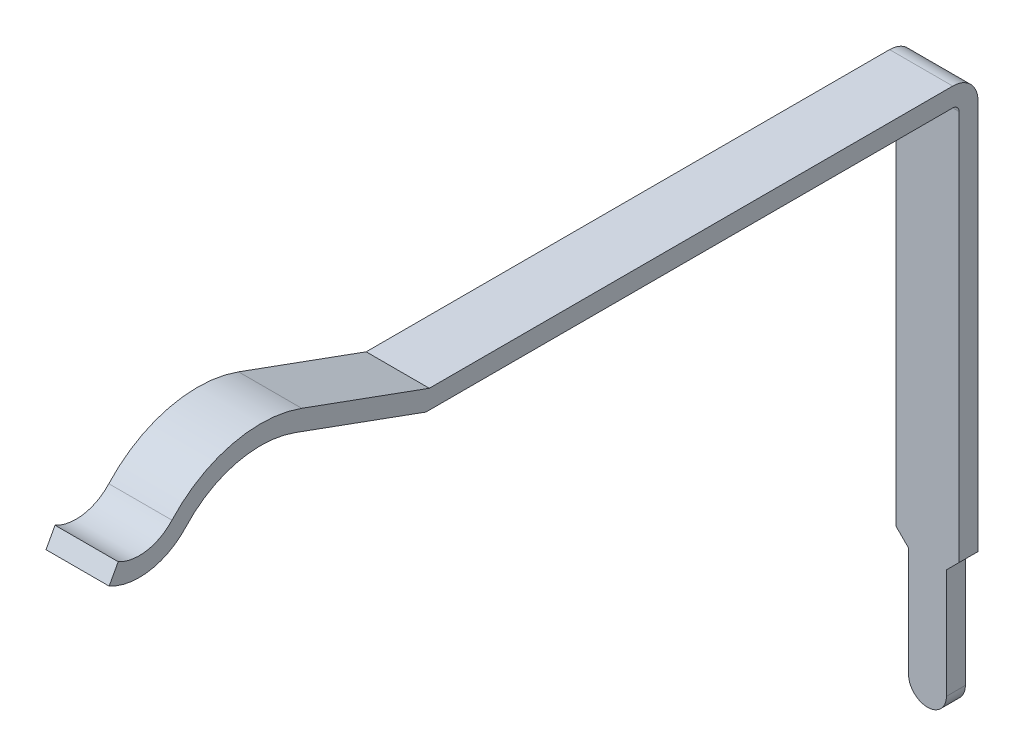
ISO-10303-21;
HEADER;
FILE_DESCRIPTION(('STEP AP214'),'2;1');
FILE_NAME('part.step','',(''),(''),'','','');
FILE_SCHEMA(('AUTOMOTIVE_DESIGN { 1 0 10303 214 1 1 1 1 }'));
ENDSEC;
DATA;
#1=APPLICATION_CONTEXT('core data for automotive mechanical design processes');
#2=APPLICATION_PROTOCOL_DEFINITION('international standard','automotive_design',2000,#1);
#3=PRODUCT_CONTEXT('',#1,'mechanical');
#4=PRODUCT('Part','Part','',(#3));
#5=PRODUCT_RELATED_PRODUCT_CATEGORY('part','',(#4));
#6=PRODUCT_DEFINITION_FORMATION('','',#4);
#7=PRODUCT_DEFINITION_CONTEXT('part definition',#1,'design');
#8=PRODUCT_DEFINITION('design','',#6,#7);
#9=PRODUCT_DEFINITION_SHAPE('','',#8);
#10=(LENGTH_UNIT() NAMED_UNIT(*) SI_UNIT(.MILLI.,.METRE.));
#11=(NAMED_UNIT(*) PLANE_ANGLE_UNIT() SI_UNIT($,.RADIAN.));
#12=(NAMED_UNIT(*) SI_UNIT($,.STERADIAN.) SOLID_ANGLE_UNIT());
#13=UNCERTAINTY_MEASURE_WITH_UNIT(LENGTH_MEASURE(1.E-05),#10,'distance_accuracy_value','');
#14=(GEOMETRIC_REPRESENTATION_CONTEXT(3) GLOBAL_UNCERTAINTY_ASSIGNED_CONTEXT((#13)) GLOBAL_UNIT_ASSIGNED_CONTEXT((#10,
#11,#12)) REPRESENTATION_CONTEXT('',''));
#15=CARTESIAN_POINT('',(0.,0.,0.));
#16=DIRECTION('',(0.,0.,1.));
#17=DIRECTION('',(1.,0.,0.));
#18=AXIS2_PLACEMENT_3D('',#15,#16,#17);
#19=CARTESIAN_POINT('',(0.5,-0.1,-14.36));
#20=DIRECTION('',(-1.,0.,0.));
#21=DIRECTION('',(0.,0.,1.));
#22=AXIS2_PLACEMENT_3D('',#19,#20,#21);
#23=CYLINDRICAL_SURFACE('',#22,0.399999999999999);
#24=DIRECTION('',(-1.,0.,0.));
#25=VECTOR('',#24,1.);
#26=CARTESIAN_POINT('',(0.,0.3,-14.36));
#27=LINE('',#26,#25);
#28=CARTESIAN_POINT('',(0.5,0.300000000311152,-14.36));
#29=VERTEX_POINT('',#28);
#30=CARTESIAN_POINT('',(-0.5,0.300000000311152,-14.36));
#31=VERTEX_POINT('',#30);
#32=EDGE_CURVE('E200',#29,#31,#27,.T.);
#33=ORIENTED_EDGE('',*,*,#32,.F.);
#34=CARTESIAN_POINT('',(0.5,-0.1,-14.36));
#35=DIRECTION('',(-1.,0.,0.));
#36=DIRECTION('',(0.,0.,1.));
#37=AXIS2_PLACEMENT_3D('',#34,#35,#36);
#38=CIRCLE('',#37,0.399999999999999);
#39=CARTESIAN_POINT('',(0.5,-0.1,-14.76));
#40=VERTEX_POINT('',#39);
#41=EDGE_CURVE('E237',#40,#29,#38,.F.);
#42=ORIENTED_EDGE('',*,*,#41,.F.);
#43=DIRECTION('',(1.,0.,0.));
#44=VECTOR('',#43,1.);
#45=CARTESIAN_POINT('',(0.,-0.1,-14.76));
#46=LINE('',#45,#44);
#47=CARTESIAN_POINT('',(-0.5,-0.1,-14.76));
#48=VERTEX_POINT('',#47);
#49=EDGE_CURVE('E151',#48,#40,#46,.T.);
#50=ORIENTED_EDGE('',*,*,#49,.F.);
#51=CARTESIAN_POINT('',(-0.5,-0.1,-14.36));
#52=DIRECTION('',(-1.,0.,0.));
#53=DIRECTION('',(0.,0.,1.));
#54=AXIS2_PLACEMENT_3D('',#51,#52,#53);
#55=CIRCLE('',#54,0.399999999999999);
#56=EDGE_CURVE('E205',#48,#31,#55,.F.);
#57=ORIENTED_EDGE('',*,*,#56,.T.);
#58=EDGE_LOOP('',(#33,#42,#50,#57));
#59=FACE_BOUND('',#58,.T.);
#60=ADVANCED_FACE('F16',(#59),#23,.T.);
#61=CARTESIAN_POINT('',(-0.5,0.3,-14.36));
#62=DIRECTION('',(0.,1.,0.));
#63=DIRECTION('',(0.,0.,1.));
#64=AXIS2_PLACEMENT_3D('',#61,#62,#63);
#65=PLANE('',#64);
#66=DIRECTION('',(0.,0.,1.));
#67=VECTOR('',#66,1.);
#68=CARTESIAN_POINT('',(0.5,0.300000000622303,-7.83872));
#69=LINE('',#68,#67);
#70=CARTESIAN_POINT('',(0.5,0.300000000466727,-6.07037707311936));
#71=VERTEX_POINT('',#70);
#72=EDGE_CURVE('E236',#29,#71,#69,.T.);
#73=ORIENTED_EDGE('',*,*,#72,.F.);
#74=ORIENTED_EDGE('',*,*,#32,.T.);
#75=DIRECTION('',(0.,0.,1.));
#76=VECTOR('',#75,1.);
#77=CARTESIAN_POINT('',(-0.5,0.300000000622303,-7.83872));
#78=LINE('',#77,#76);
#79=CARTESIAN_POINT('',(-0.5,0.300000000311152,-6.07037706914512));
#80=VERTEX_POINT('',#79);
#81=EDGE_CURVE('E262',#31,#80,#78,.T.);
#82=ORIENTED_EDGE('',*,*,#81,.T.);
#83=DIRECTION('',(-1.,0.,0.));
#84=VECTOR('',#83,1.);
#85=CARTESIAN_POINT('',(0.,0.3,-6.07037707));
#86=LINE('',#85,#84);
#87=EDGE_CURVE('E198',#71,#80,#86,.T.);
#88=ORIENTED_EDGE('',*,*,#87,.F.);
#89=EDGE_LOOP('',(#73,#74,#82,#88));
#90=FACE_BOUND('',#89,.T.);
#91=ADVANCED_FACE('F367',(#90),#65,.T.);
#92=CARTESIAN_POINT('',(-0.5,0.3,-6.07037707));
#93=DIRECTION('',(0.,0.939692620883365,-0.342020143057909));
#94=DIRECTION('',(0.,0.342020143057909,0.939692620883365));
#95=AXIS2_PLACEMENT_3D('',#92,#93,#94);
#96=PLANE('',#95);
#97=DIRECTION('',(0.,0.342020140746785,0.939692621724545));
#98=VECTOR('',#97,1.);
#99=CARTESIAN_POINT('',(0.5,0.300000000622303,-6.07037707623872));
#100=LINE('',#99,#98);
#101=CARTESIAN_POINT('',(0.5,1.03541597897149,-4.04983826915849));
#102=VERTEX_POINT('',#101);
#103=EDGE_CURVE('E234',#71,#102,#100,.T.);
#104=ORIENTED_EDGE('',*,*,#103,.F.);
#105=ORIENTED_EDGE('',*,*,#87,.T.);
#106=DIRECTION('',(0.,0.342020143057909,0.939692620883365));
#107=VECTOR('',#106,1.);
#108=CARTESIAN_POINT('',(-0.5,0.3,-6.07037707));
#109=LINE('',#108,#107);
#110=CARTESIAN_POINT('',(-0.5,1.03541597937978,-4.04983827179352));
#111=VERTEX_POINT('',#110);
#112=EDGE_CURVE('E260',#80,#111,#109,.T.);
#113=ORIENTED_EDGE('',*,*,#112,.T.);
#114=DIRECTION('',(-1.,0.,0.));
#115=VECTOR('',#114,1.);
#116=CARTESIAN_POINT('',(0.,1.03541597961914,-4.04983827197282));
#117=LINE('',#116,#115);
#118=EDGE_CURVE('E195',#111,#102,#117,.F.);
#119=ORIENTED_EDGE('',*,*,#118,.T.);
#120=EDGE_LOOP('',(#104,#105,#113,#119));
#121=FACE_BOUND('',#120,.T.);
#122=ADVANCED_FACE('F363',(#121),#96,.T.);
#123=CARTESIAN_POINT('',(0.5,-0.75,-3.4));
#124=DIRECTION('',(-1.,0.,0.));
#125=DIRECTION('',(0.,0.,1.));
#126=AXIS2_PLACEMENT_3D('',#123,#124,#125);
#127=CYLINDRICAL_SURFACE('',#126,1.9);
#128=DIRECTION('',(1.,0.,0.));
#129=VECTOR('',#128,1.);
#130=CARTESIAN_POINT('',(0.,0.52884615384742,-1.99481228515964));
#131=LINE('',#130,#129);
#132=CARTESIAN_POINT('',(0.5,0.528846153901887,-1.99481228505774));
#133=VERTEX_POINT('',#132);
#134=CARTESIAN_POINT('',(-0.5,0.528846153826487,-1.99481228514059));
#135=VERTEX_POINT('',#134);
#136=EDGE_CURVE('E193',#133,#135,#131,.F.);
#137=ORIENTED_EDGE('',*,*,#136,.F.);
#138=CARTESIAN_POINT('',(0.5,-0.75,-3.4));
#139=DIRECTION('',(-1.,0.,0.));
#140=DIRECTION('',(0.,0.,1.));
#141=AXIS2_PLACEMENT_3D('',#138,#139,#140);
#142=CIRCLE('',#141,1.9);
#143=EDGE_CURVE('E232',#102,#133,#142,.F.);
#144=ORIENTED_EDGE('',*,*,#143,.F.);
#145=ORIENTED_EDGE('',*,*,#118,.F.);
#146=CARTESIAN_POINT('',(-0.5,-0.75,-3.4));
#147=DIRECTION('',(-1.,0.,0.));
#148=DIRECTION('',(0.,0.,1.));
#149=AXIS2_PLACEMENT_3D('',#146,#147,#148);
#150=CIRCLE('',#149,1.9);
#151=EDGE_CURVE('E257',#111,#135,#150,.F.);
#152=ORIENTED_EDGE('',*,*,#151,.T.);
#153=EDGE_LOOP('',(#137,#144,#145,#152));
#154=FACE_BOUND('',#153,.T.);
#155=ADVANCED_FACE('F366',(#154),#127,.T.);
#156=CARTESIAN_POINT('',(0.5,1.,-1.477111548));
#157=DIRECTION('',(-1.,0.,0.));
#158=DIRECTION('',(0.,0.,1.));
#159=AXIS2_PLACEMENT_3D('',#156,#157,#158);
#160=CYLINDRICAL_SURFACE('',#159,0.7);
#161=CARTESIAN_POINT('',(0.5,1.,-1.477111548));
#162=DIRECTION('',(-1.,0.,0.));
#163=DIRECTION('',(0.,0.,1.));
#164=AXIS2_PLACEMENT_3D('',#161,#162,#163);
#165=CIRCLE('',#164,0.7);
#166=CARTESIAN_POINT('',(0.5,0.38481007960968,-1.14313346157592));
#167=VERTEX_POINT('',#166);
#168=EDGE_CURVE('E230',#133,#167,#165,.T.);
#169=ORIENTED_EDGE('',*,*,#168,.F.);
#170=ORIENTED_EDGE('',*,*,#136,.T.);
#171=CARTESIAN_POINT('',(-0.5,1.,-1.477111548));
#172=DIRECTION('',(-1.,0.,0.));
#173=DIRECTION('',(0.,0.,1.));
#174=AXIS2_PLACEMENT_3D('',#171,#172,#173);
#175=CIRCLE('',#174,0.7);
#176=CARTESIAN_POINT('',(-0.5,0.384810078226828,-1.14313346412314));
#177=VERTEX_POINT('',#176);
#178=EDGE_CURVE('E254',#135,#177,#175,.T.);
#179=ORIENTED_EDGE('',*,*,#178,.T.);
#180=DIRECTION('',(-1.,0.,0.));
#181=VECTOR('',#180,1.);
#182=CARTESIAN_POINT('',(0.,0.384810078,-1.143133464));
#183=LINE('',#182,#181);
#184=EDGE_CURVE('E191',#167,#177,#183,.T.);
#185=ORIENTED_EDGE('',*,*,#184,.F.);
#186=EDGE_LOOP('',(#169,#170,#179,#185));
#187=FACE_BOUND('',#186,.T.);
#188=ADVANCED_FACE('F361',(#187),#160,.F.);
#189=CARTESIAN_POINT('',(-0.5,0.384810078,-1.143133464));
#190=DIRECTION('',(0.,0.477111547746772,0.878842745322893));
#191=DIRECTION('',(0.,-0.878842745322893,0.477111547746772));
#192=AXIS2_PLACEMENT_3D('',#189,#190,#191);
#193=PLANE('',#192);
#194=DIRECTION('',(0.,-0.878842757719991,0.477111524911232));
#195=VECTOR('',#194,1.);
#196=CARTESIAN_POINT('',(0.5,0.384810080288333,-1.1431334586464));
#197=LINE('',#196,#195);
#198=CARTESIAN_POINT('',(0.5,0.121157254244879,-1.00000000104939));
#199=VERTEX_POINT('',#198);
#200=EDGE_CURVE('E228',#167,#199,#197,.T.);
#201=ORIENTED_EDGE('',*,*,#200,.F.);
#202=ORIENTED_EDGE('',*,*,#184,.T.);
#203=DIRECTION('',(0.,-0.878842745322893,0.477111547746772));
#204=VECTOR('',#203,1.);
#205=CARTESIAN_POINT('',(-0.5,0.384810078,-1.143133464));
#206=LINE('',#205,#204);
#207=CARTESIAN_POINT('',(-0.5,0.121157254721593,-1.00000000017128));
#208=VERTEX_POINT('',#207);
#209=EDGE_CURVE('E251',#177,#208,#206,.T.);
#210=ORIENTED_EDGE('',*,*,#209,.T.);
#211=DIRECTION('',(-1.,0.,0.));
#212=VECTOR('',#211,1.);
#213=CARTESIAN_POINT('',(0.,0.121157254586397,-1.00000000042032));
#214=LINE('',#213,#212);
#215=EDGE_CURVE('E188',#208,#199,#214,.F.);
#216=ORIENTED_EDGE('',*,*,#215,.T.);
#217=EDGE_LOOP('',(#201,#202,#210,#216));
#218=FACE_BOUND('',#217,.T.);
#219=ADVANCED_FACE('F357',(#218),#193,.T.);
#220=CARTESIAN_POINT('',(0.5,1.,-1.477111548));
#221=DIRECTION('',(-1.,0.,0.));
#222=DIRECTION('',(0.,0.,1.));
#223=AXIS2_PLACEMENT_3D('',#220,#221,#222);
#224=CYLINDRICAL_SURFACE('',#223,1.);
#225=DIRECTION('',(1.,0.,0.));
#226=VECTOR('',#225,1.);
#227=CARTESIAN_POINT('',(0.,0.326923076434778,-2.21668402890764));
#228=LINE('',#227,#226);
#229=CARTESIAN_POINT('',(0.5,0.326923076649927,-2.21668402925492));
#230=VERTEX_POINT('',#229);
#231=CARTESIAN_POINT('',(-0.5,0.326923076725328,-2.21668402917207));
#232=VERTEX_POINT('',#231);
#233=EDGE_CURVE('E186',#230,#232,#228,.F.);
#234=ORIENTED_EDGE('',*,*,#233,.F.);
#235=CARTESIAN_POINT('',(0.5,1.,-1.477111548));
#236=DIRECTION('',(-1.,0.,0.));
#237=DIRECTION('',(0.,0.,1.));
#238=AXIS2_PLACEMENT_3D('',#235,#236,#237);
#239=CIRCLE('',#238,1.);
#240=EDGE_CURVE('E226',#199,#230,#239,.F.);
#241=ORIENTED_EDGE('',*,*,#240,.F.);
#242=ORIENTED_EDGE('',*,*,#215,.F.);
#243=CARTESIAN_POINT('',(-0.5,1.,-1.477111548));
#244=DIRECTION('',(-1.,0.,0.));
#245=DIRECTION('',(0.,0.,1.));
#246=AXIS2_PLACEMENT_3D('',#243,#244,#245);
#247=CIRCLE('',#246,1.);
#248=EDGE_CURVE('E248',#208,#232,#247,.F.);
#249=ORIENTED_EDGE('',*,*,#248,.T.);
#250=EDGE_LOOP('',(#234,#241,#242,#249));
#251=FACE_BOUND('',#250,.T.);
#252=ADVANCED_FACE('F360',(#251),#224,.T.);
#253=CARTESIAN_POINT('',(0.5,-0.75,-3.4));
#254=DIRECTION('',(-1.,0.,0.));
#255=DIRECTION('',(0.,0.,1.));
#256=AXIS2_PLACEMENT_3D('',#253,#254,#255);
#257=CYLINDRICAL_SURFACE('',#256,1.6);
#258=CARTESIAN_POINT('',(0.5,-0.75,-3.4));
#259=DIRECTION('',(-1.,0.,0.));
#260=DIRECTION('',(0.,0.,1.));
#261=AXIS2_PLACEMENT_3D('',#258,#259,#260);
#262=CIRCLE('',#261,1.6);
#263=CARTESIAN_POINT('',(0.5,0.753508193627589,-3.94723223066755));
#264=VERTEX_POINT('',#263);
#265=EDGE_CURVE('E224',#230,#264,#262,.T.);
#266=ORIENTED_EDGE('',*,*,#265,.F.);
#267=ORIENTED_EDGE('',*,*,#233,.T.);
#268=CARTESIAN_POINT('',(-0.5,-0.75,-3.4));
#269=DIRECTION('',(-1.,0.,0.));
#270=DIRECTION('',(0.,0.,1.));
#271=AXIS2_PLACEMENT_3D('',#268,#269,#270);
#272=CIRCLE('',#271,1.6);
#273=CARTESIAN_POINT('',(-0.5,0.753508193021166,-3.94723222894185));
#274=VERTEX_POINT('',#273);
#275=EDGE_CURVE('E245',#232,#274,#272,.T.);
#276=ORIENTED_EDGE('',*,*,#275,.T.);
#277=DIRECTION('',(1.,0.,0.));
#278=VECTOR('',#277,1.);
#279=CARTESIAN_POINT('',(0.,0.753508193,-3.947232229));
#280=LINE('',#279,#278);
#281=EDGE_CURVE('E183',#274,#264,#280,.T.);
#282=ORIENTED_EDGE('',*,*,#281,.T.);
#283=EDGE_LOOP('',(#266,#267,#276,#282));
#284=FACE_BOUND('',#283,.T.);
#285=ADVANCED_FACE('F355',(#284),#257,.F.);
#286=CARTESIAN_POINT('',(-0.5,0.,-6.017478976));
#287=DIRECTION('',(0.,0.939692620858037,-0.342020143127497));
#288=DIRECTION('',(0.,0.342020143127497,0.939692620858037));
#289=AXIS2_PLACEMENT_3D('',#286,#287,#288);
#290=PLANE('',#289);
#291=DIRECTION('',(1.,0.,0.));
#292=VECTOR('',#291,1.);
#293=CARTESIAN_POINT('',(0.,0.,-6.017478976));
#294=LINE('',#293,#292);
#295=CARTESIAN_POINT('',(-0.5,-1.3890104451685E-09,-6.01747897981627));
#296=VERTEX_POINT('',#295);
#297=CARTESIAN_POINT('',(0.5,-1.75888896004374E-09,-6.01747897737994));
#298=VERTEX_POINT('',#297);
#299=EDGE_CURVE('E180',#296,#298,#294,.T.);
#300=ORIENTED_EDGE('',*,*,#299,.T.);
#301=DIRECTION('',(0.,-0.342020144788669,-0.93969262025342));
#302=VECTOR('',#301,1.);
#303=CARTESIAN_POINT('',(0.5,0.753508195005623,-3.94723223027328));
#304=LINE('',#303,#302);
#305=EDGE_CURVE('E222',#264,#298,#304,.T.);
#306=ORIENTED_EDGE('',*,*,#305,.F.);
#307=ORIENTED_EDGE('',*,*,#281,.F.);
#308=DIRECTION('',(0.,0.342020143127497,0.939692620858037));
#309=VECTOR('',#308,1.);
#310=CARTESIAN_POINT('',(-0.5,0.,-6.017478976));
#311=LINE('',#310,#309);
#312=EDGE_CURVE('E241',#274,#296,#311,.F.);
#313=ORIENTED_EDGE('',*,*,#312,.T.);
#314=EDGE_LOOP('',(#300,#306,#307,#313));
#315=FACE_BOUND('',#314,.T.);
#316=ADVANCED_FACE('F352',(#315),#290,.F.);
#317=CARTESIAN_POINT('',(-0.5,0.,-14.36));
#318=DIRECTION('',(0.,1.,0.));
#319=DIRECTION('',(0.,0.,1.));
#320=AXIS2_PLACEMENT_3D('',#317,#318,#319);
#321=PLANE('',#320);
#322=DIRECTION('',(1.,0.,0.));
#323=VECTOR('',#322,1.);
#324=CARTESIAN_POINT('',(0.,0.,-14.3600000000205));
#325=LINE('',#324,#323);
#326=CARTESIAN_POINT('',(0.5,-1.38901065128982E-09,-14.3600000000103));
#327=VERTEX_POINT('',#326);
#328=CARTESIAN_POINT('',(-0.5,-1.38901065128982E-09,-14.3600000000103));
#329=VERTEX_POINT('',#328);
#330=EDGE_CURVE('E175',#327,#329,#325,.F.);
#331=ORIENTED_EDGE('',*,*,#330,.F.);
#332=DIRECTION('',(0.,0.,-1.));
#333=VECTOR('',#332,1.);
#334=CARTESIAN_POINT('',(0.5,-2.77802130257965E-09,-7.83872));
#335=LINE('',#334,#333);
#336=EDGE_CURVE('E221',#298,#327,#335,.T.);
#337=ORIENTED_EDGE('',*,*,#336,.F.);
#338=ORIENTED_EDGE('',*,*,#299,.F.);
#339=DIRECTION('',(0.,0.,-1.));
#340=VECTOR('',#339,1.);
#341=CARTESIAN_POINT('',(-0.5,-2.77802130257965E-09,-7.83872));
#342=LINE('',#341,#340);
#343=EDGE_CURVE('E244',#296,#329,#342,.T.);
#344=ORIENTED_EDGE('',*,*,#343,.T.);
#345=EDGE_LOOP('',(#331,#337,#338,#344));
#346=FACE_BOUND('',#345,.T.);
#347=ADVANCED_FACE('F285',(#346),#321,.F.);
#348=CARTESIAN_POINT('',(0.5,-8.57052,-14.76));
#349=DIRECTION('',(0.,0.,-1.));
#350=DIRECTION('',(-1.,0.,0.));
#351=AXIS2_PLACEMENT_3D('',#348,#349,#350);
#352=PLANE('',#351);
#353=ORIENTED_EDGE('',*,*,#49,.T.);
#354=DIRECTION('',(0.,1.,0.));
#355=VECTOR('',#354,1.);
#356=CARTESIAN_POINT('',(0.5,-2.5453267095,-14.76));
#357=LINE('',#356,#355);
#358=CARTESIAN_POINT('',(0.5,-6.285265009,-14.76));
#359=VERTEX_POINT('',#358);
#360=EDGE_CURVE('E178',#359,#40,#357,.T.);
#361=ORIENTED_EDGE('',*,*,#360,.F.);
#362=DIRECTION('',(-0.707106781186547,-0.707106781186548,0.));
#363=VECTOR('',#362,1.);
#364=CARTESIAN_POINT('',(0.4,-6.385265009,-14.76));
#365=LINE('',#364,#363);
#366=CARTESIAN_POINT('',(0.3,-6.485265009,-14.76));
#367=VERTEX_POINT('',#366);
#368=EDGE_CURVE('E140',#359,#367,#365,.T.);
#369=ORIENTED_EDGE('',*,*,#368,.T.);
#370=DIRECTION('',(0.,-1.,0.));
#371=VECTOR('',#370,1.);
#372=CARTESIAN_POINT('',(0.3,-7.3526325045,-14.76));
#373=LINE('',#372,#371);
#374=CARTESIAN_POINT('',(0.3,-8.22,-14.76));
#375=VERTEX_POINT('',#374);
#376=EDGE_CURVE('E149',#367,#375,#373,.T.);
#377=ORIENTED_EDGE('',*,*,#376,.T.);
#378=CARTESIAN_POINT('',(0.,-8.22,-14.76));
#379=DIRECTION('',(0.,0.,1.));
#380=DIRECTION('',(0.,-1.,0.));
#381=AXIS2_PLACEMENT_3D('',#378,#379,#380);
#382=CIRCLE('',#381,0.3);
#383=CARTESIAN_POINT('',(-0.3,-8.22,-14.76));
#384=VERTEX_POINT('',#383);
#385=EDGE_CURVE('E20',#375,#384,#382,.F.);
#386=ORIENTED_EDGE('',*,*,#385,.T.);
#387=DIRECTION('',(0.,1.,0.));
#388=VECTOR('',#387,1.);
#389=CARTESIAN_POINT('',(-0.3,-7.3526325045,-14.76));
#390=LINE('',#389,#388);
#391=CARTESIAN_POINT('',(-0.3,-6.485265009,-14.76));
#392=VERTEX_POINT('',#391);
#393=EDGE_CURVE('E146',#384,#392,#390,.T.);
#394=ORIENTED_EDGE('',*,*,#393,.T.);
#395=DIRECTION('',(-0.707106781186547,0.707106781186548,0.));
#396=VECTOR('',#395,1.);
#397=CARTESIAN_POINT('',(-0.4,-6.385265009,-14.76));
#398=LINE('',#397,#396);
#399=CARTESIAN_POINT('',(-0.5,-6.285265009,-14.76));
#400=VERTEX_POINT('',#399);
#401=EDGE_CURVE('E203',#392,#400,#398,.T.);
#402=ORIENTED_EDGE('',*,*,#401,.T.);
#403=DIRECTION('',(0.,1.,0.));
#404=VECTOR('',#403,1.);
#405=CARTESIAN_POINT('',(-0.5,-2.5453267095,-14.76));
#406=LINE('',#405,#404);
#407=EDGE_CURVE('E240',#400,#48,#406,.T.);
#408=ORIENTED_EDGE('',*,*,#407,.T.);
#409=EDGE_LOOP('',(#353,#361,#369,#377,#386,#394,#402,#408));
#410=FACE_BOUND('',#409,.T.);
#411=ADVANCED_FACE('F148',(#410),#352,.T.);
#412=CARTESIAN_POINT('',(0.,-8.22,-14.76));
#413=DIRECTION('',(0.,0.,1.));
#414=DIRECTION('',(0.,-1.,0.));
#415=AXIS2_PLACEMENT_3D('',#412,#413,#414);
#416=CYLINDRICAL_SURFACE('',#415,0.3);
#417=ORIENTED_EDGE('',*,*,#385,.F.);
#418=DIRECTION('',(0.,0.,1.));
#419=VECTOR('',#418,1.);
#420=CARTESIAN_POINT('',(0.3,-8.22,-14.61));
#421=LINE('',#420,#419);
#422=CARTESIAN_POINT('',(0.3,-8.22,-14.46));
#423=VERTEX_POINT('',#422);
#424=EDGE_CURVE('E168',#375,#423,#421,.T.);
#425=ORIENTED_EDGE('',*,*,#424,.T.);
#426=CARTESIAN_POINT('',(0.,-8.22,-14.46));
#427=DIRECTION('',(0.,0.,1.));
#428=DIRECTION('',(0.,-1.,0.));
#429=AXIS2_PLACEMENT_3D('',#426,#427,#428);
#430=CIRCLE('',#429,0.3);
#431=CARTESIAN_POINT('',(-0.3,-8.22,-14.46));
#432=VERTEX_POINT('',#431);
#433=EDGE_CURVE('E161',#423,#432,#430,.F.);
#434=ORIENTED_EDGE('',*,*,#433,.T.);
#435=DIRECTION('',(0.,0.,-1.));
#436=VECTOR('',#435,1.);
#437=CARTESIAN_POINT('',(-0.3,-8.22,-14.61));
#438=LINE('',#437,#436);
#439=EDGE_CURVE('E150',#432,#384,#438,.T.);
#440=ORIENTED_EDGE('',*,*,#439,.T.);
#441=EDGE_LOOP('',(#417,#425,#434,#440));
#442=FACE_BOUND('',#441,.T.);
#443=ADVANCED_FACE('F160',(#442),#416,.T.);
#444=CARTESIAN_POINT('',(-0.3,-8.22,-14.46));
#445=DIRECTION('',(1.,0.,0.));
#446=DIRECTION('',(0.,0.,-1.));
#447=AXIS2_PLACEMENT_3D('',#444,#445,#446);
#448=PLANE('',#447);
#449=ORIENTED_EDGE('',*,*,#393,.F.);
#450=ORIENTED_EDGE('',*,*,#439,.F.);
#451=DIRECTION('',(0.,1.,0.));
#452=VECTOR('',#451,1.);
#453=CARTESIAN_POINT('',(-0.3,-4.33526,-14.46));
#454=LINE('',#453,#452);
#455=CARTESIAN_POINT('',(-0.3,-6.485265009,-14.46));
#456=VERTEX_POINT('',#455);
#457=EDGE_CURVE('E217',#432,#456,#454,.T.);
#458=ORIENTED_EDGE('',*,*,#457,.T.);
#459=DIRECTION('',(0.,0.,-1.));
#460=VECTOR('',#459,1.);
#461=CARTESIAN_POINT('',(-0.3,-6.485265009,-14.61));
#462=LINE('',#461,#460);
#463=EDGE_CURVE('E157',#456,#392,#462,.T.);
#464=ORIENTED_EDGE('',*,*,#463,.T.);
#465=EDGE_LOOP('',(#449,#450,#458,#464));
#466=FACE_BOUND('',#465,.T.);
#467=ADVANCED_FACE('F154',(#466),#448,.F.);
#468=CARTESIAN_POINT('',(-0.3,-6.485265009,-14.76));
#469=DIRECTION('',(0.707106781186548,0.707106781186547,0.));
#470=DIRECTION('',(-0.707106781186547,0.707106781186548,0.));
#471=AXIS2_PLACEMENT_3D('',#468,#469,#470);
#472=PLANE('',#471);
#473=ORIENTED_EDGE('',*,*,#401,.F.);
#474=ORIENTED_EDGE('',*,*,#463,.F.);
#475=DIRECTION('',(-0.707106781186547,0.707106781186548,0.));
#476=VECTOR('',#475,1.);
#477=CARTESIAN_POINT('',(-0.3,-6.485265009,-14.46));
#478=LINE('',#477,#476);
#479=CARTESIAN_POINT('',(-0.5,-6.285265009,-14.46));
#480=VERTEX_POINT('',#479);
#481=EDGE_CURVE('E213',#456,#480,#478,.T.);
#482=ORIENTED_EDGE('',*,*,#481,.T.);
#483=DIRECTION('',(0.,0.,-1.));
#484=VECTOR('',#483,1.);
#485=CARTESIAN_POINT('',(-0.5,-6.285265009,-7.83872));
#486=LINE('',#485,#484);
#487=EDGE_CURVE('E275',#480,#400,#486,.T.);
#488=ORIENTED_EDGE('',*,*,#487,.T.);
#489=EDGE_LOOP('',(#473,#474,#482,#488));
#490=FACE_BOUND('',#489,.T.);
#491=ADVANCED_FACE('F323',(#490),#472,.F.);
#492=CARTESIAN_POINT('',(-0.5,-6.285265009,-0.91744));
#493=DIRECTION('',(1.,0.,0.));
#494=DIRECTION('',(0.,0.,-1.));
#495=AXIS2_PLACEMENT_3D('',#492,#493,#494);
#496=PLANE('',#495);
#497=ORIENTED_EDGE('',*,*,#487,.F.);
#498=DIRECTION('',(0.,1.,0.));
#499=VECTOR('',#498,1.);
#500=CARTESIAN_POINT('',(-0.5,-4.33526,-14.46));
#501=LINE('',#500,#499);
#502=CARTESIAN_POINT('',(-0.5,-0.1,-14.46));
#503=VERTEX_POINT('',#502);
#504=EDGE_CURVE('E216',#480,#503,#501,.T.);
#505=ORIENTED_EDGE('',*,*,#504,.T.);
#506=CARTESIAN_POINT('',(-0.5,-0.1,-14.36));
#507=DIRECTION('',(-1.,0.,0.));
#508=DIRECTION('',(0.,0.,1.));
#509=AXIS2_PLACEMENT_3D('',#506,#507,#508);
#510=CIRCLE('',#509,0.100000000000001);
#511=EDGE_CURVE('E179',#329,#503,#510,.T.);
#512=ORIENTED_EDGE('',*,*,#511,.F.);
#513=ORIENTED_EDGE('',*,*,#343,.F.);
#514=ORIENTED_EDGE('',*,*,#312,.F.);
#515=ORIENTED_EDGE('',*,*,#275,.F.);
#516=ORIENTED_EDGE('',*,*,#248,.F.);
#517=ORIENTED_EDGE('',*,*,#209,.F.);
#518=ORIENTED_EDGE('',*,*,#178,.F.);
#519=ORIENTED_EDGE('',*,*,#151,.F.);
#520=ORIENTED_EDGE('',*,*,#112,.F.);
#521=ORIENTED_EDGE('',*,*,#81,.F.);
#522=ORIENTED_EDGE('',*,*,#56,.F.);
#523=ORIENTED_EDGE('',*,*,#407,.F.);
#524=EDGE_LOOP('',(#497,#505,#512,#513,#514,#515,#516,#517,#518,#519,#520,#521,#522,#523));
#525=FACE_BOUND('',#524,.T.);
#526=ADVANCED_FACE('F296',(#525),#496,.F.);
#527=CARTESIAN_POINT('',(0.5,-0.1,-14.36));
#528=DIRECTION('',(-1.,0.,0.));
#529=DIRECTION('',(0.,0.,1.));
#530=AXIS2_PLACEMENT_3D('',#527,#528,#529);
#531=CYLINDRICAL_SURFACE('',#530,0.100000000000001);
#532=CARTESIAN_POINT('',(0.5,-0.1,-14.36));
#533=DIRECTION('',(-1.,0.,0.));
#534=DIRECTION('',(0.,0.,1.));
#535=AXIS2_PLACEMENT_3D('',#532,#533,#534);
#536=CIRCLE('',#535,0.100000000000001);
#537=CARTESIAN_POINT('',(0.5,-0.1,-14.46));
#538=VERTEX_POINT('',#537);
#539=EDGE_CURVE('E219',#327,#538,#536,.T.);
#540=ORIENTED_EDGE('',*,*,#539,.F.);
#541=ORIENTED_EDGE('',*,*,#330,.T.);
#542=ORIENTED_EDGE('',*,*,#511,.T.);
#543=DIRECTION('',(1.,0.,0.));
#544=VECTOR('',#543,1.);
#545=CARTESIAN_POINT('',(0.,-0.1,-14.46));
#546=LINE('',#545,#544);
#547=EDGE_CURVE('E301',#503,#538,#546,.T.);
#548=ORIENTED_EDGE('',*,*,#547,.T.);
#549=EDGE_LOOP('',(#540,#541,#542,#548));
#550=FACE_BOUND('',#549,.T.);
#551=ADVANCED_FACE('F292',(#550),#531,.F.);
#552=CARTESIAN_POINT('',(0.5,-6.285265009,-0.91744));
#553=DIRECTION('',(1.,0.,0.));
#554=DIRECTION('',(0.,0.,-1.));
#555=AXIS2_PLACEMENT_3D('',#552,#553,#554);
#556=PLANE('',#555);
#557=ORIENTED_EDGE('',*,*,#539,.T.);
#558=DIRECTION('',(0.,-1.,0.));
#559=VECTOR('',#558,1.);
#560=CARTESIAN_POINT('',(0.5,-4.33526,-14.46));
#561=LINE('',#560,#559);
#562=CARTESIAN_POINT('',(0.5,-6.285265009,-14.46));
#563=VERTEX_POINT('',#562);
#564=EDGE_CURVE('E212',#538,#563,#561,.T.);
#565=ORIENTED_EDGE('',*,*,#564,.T.);
#566=DIRECTION('',(0.,0.,-1.));
#567=VECTOR('',#566,1.);
#568=CARTESIAN_POINT('',(0.5,-6.285265009,-14.61));
#569=LINE('',#568,#567);
#570=EDGE_CURVE('E172',#563,#359,#569,.T.);
#571=ORIENTED_EDGE('',*,*,#570,.T.);
#572=ORIENTED_EDGE('',*,*,#360,.T.);
#573=ORIENTED_EDGE('',*,*,#41,.T.);
#574=ORIENTED_EDGE('',*,*,#72,.T.);
#575=ORIENTED_EDGE('',*,*,#103,.T.);
#576=ORIENTED_EDGE('',*,*,#143,.T.);
#577=ORIENTED_EDGE('',*,*,#168,.T.);
#578=ORIENTED_EDGE('',*,*,#200,.T.);
#579=ORIENTED_EDGE('',*,*,#240,.T.);
#580=ORIENTED_EDGE('',*,*,#265,.T.);
#581=ORIENTED_EDGE('',*,*,#305,.T.);
#582=ORIENTED_EDGE('',*,*,#336,.T.);
#583=EDGE_LOOP('',(#557,#565,#571,#572,#573,#574,#575,#576,#577,#578,#579,#580,#581,#582));
#584=FACE_BOUND('',#583,.T.);
#585=ADVANCED_FACE('F327',(#584),#556,.T.);
#586=CARTESIAN_POINT('',(0.5,-6.285265009,-14.76));
#587=DIRECTION('',(-0.707106781186548,0.707106781186547,0.));
#588=DIRECTION('',(-0.707106781186547,-0.707106781186548,0.));
#589=AXIS2_PLACEMENT_3D('',#586,#587,#588);
#590=PLANE('',#589);
#591=ORIENTED_EDGE('',*,*,#368,.F.);
#592=ORIENTED_EDGE('',*,*,#570,.F.);
#593=DIRECTION('',(-0.707106781186547,-0.707106781186548,0.));
#594=VECTOR('',#593,1.);
#595=CARTESIAN_POINT('',(0.5,-6.285265009,-14.46));
#596=LINE('',#595,#594);
#597=CARTESIAN_POINT('',(0.3,-6.485265009,-14.46));
#598=VERTEX_POINT('',#597);
#599=EDGE_CURVE('E26',#563,#598,#596,.T.);
#600=ORIENTED_EDGE('',*,*,#599,.T.);
#601=DIRECTION('',(0.,0.,-1.));
#602=VECTOR('',#601,1.);
#603=CARTESIAN_POINT('',(0.3,-6.485265009,-14.61));
#604=LINE('',#603,#602);
#605=EDGE_CURVE('E34',#598,#367,#604,.T.);
#606=ORIENTED_EDGE('',*,*,#605,.T.);
#607=EDGE_LOOP('',(#591,#592,#600,#606));
#608=FACE_BOUND('',#607,.T.);
#609=ADVANCED_FACE('F330',(#608),#590,.F.);
#610=CARTESIAN_POINT('',(0.3,-6.485265009,-14.76));
#611=DIRECTION('',(-1.,0.,0.));
#612=DIRECTION('',(0.,-1.,0.));
#613=AXIS2_PLACEMENT_3D('',#610,#611,#612);
#614=PLANE('',#613);
#615=ORIENTED_EDGE('',*,*,#376,.F.);
#616=ORIENTED_EDGE('',*,*,#605,.F.);
#617=DIRECTION('',(0.,-1.,0.));
#618=VECTOR('',#617,1.);
#619=CARTESIAN_POINT('',(0.3,-4.33526,-14.46));
#620=LINE('',#619,#618);
#621=EDGE_CURVE('E11',#598,#423,#620,.T.);
#622=ORIENTED_EDGE('',*,*,#621,.T.);
#623=ORIENTED_EDGE('',*,*,#424,.F.);
#624=EDGE_LOOP('',(#615,#616,#622,#623));
#625=FACE_BOUND('',#624,.T.);
#626=ADVANCED_FACE('F331',(#625),#614,.F.);
#627=CARTESIAN_POINT('',(0.5,-8.57052,-14.46));
#628=DIRECTION('',(0.,0.,-1.));
#629=DIRECTION('',(-1.,0.,0.));
#630=AXIS2_PLACEMENT_3D('',#627,#628,#629);
#631=PLANE('',#630);
#632=ORIENTED_EDGE('',*,*,#599,.F.);
#633=ORIENTED_EDGE('',*,*,#564,.F.);
#634=ORIENTED_EDGE('',*,*,#547,.F.);
#635=ORIENTED_EDGE('',*,*,#504,.F.);
#636=ORIENTED_EDGE('',*,*,#481,.F.);
#637=ORIENTED_EDGE('',*,*,#457,.F.);
#638=ORIENTED_EDGE('',*,*,#433,.F.);
#639=ORIENTED_EDGE('',*,*,#621,.F.);
#640=EDGE_LOOP('',(#632,#633,#634,#635,#636,#637,#638,#639));
#641=FACE_BOUND('',#640,.T.);
#642=ADVANCED_FACE('F18',(#641),#631,.F.);
#643=CLOSED_SHELL('',(#60,#91,#122,#155,#188,#219,#252,#285,#316,#347,#411,#443,#467,#491,#526,
#551,#585,#609,#626,#642));
#644=MANIFOLD_SOLID_BREP('B1',#643);
#645=ADVANCED_BREP_SHAPE_REPRESENTATION('',(#18,#644),#14);
#646=SHAPE_DEFINITION_REPRESENTATION(#9,#645);
ENDSEC;
END-ISO-10303-21;
